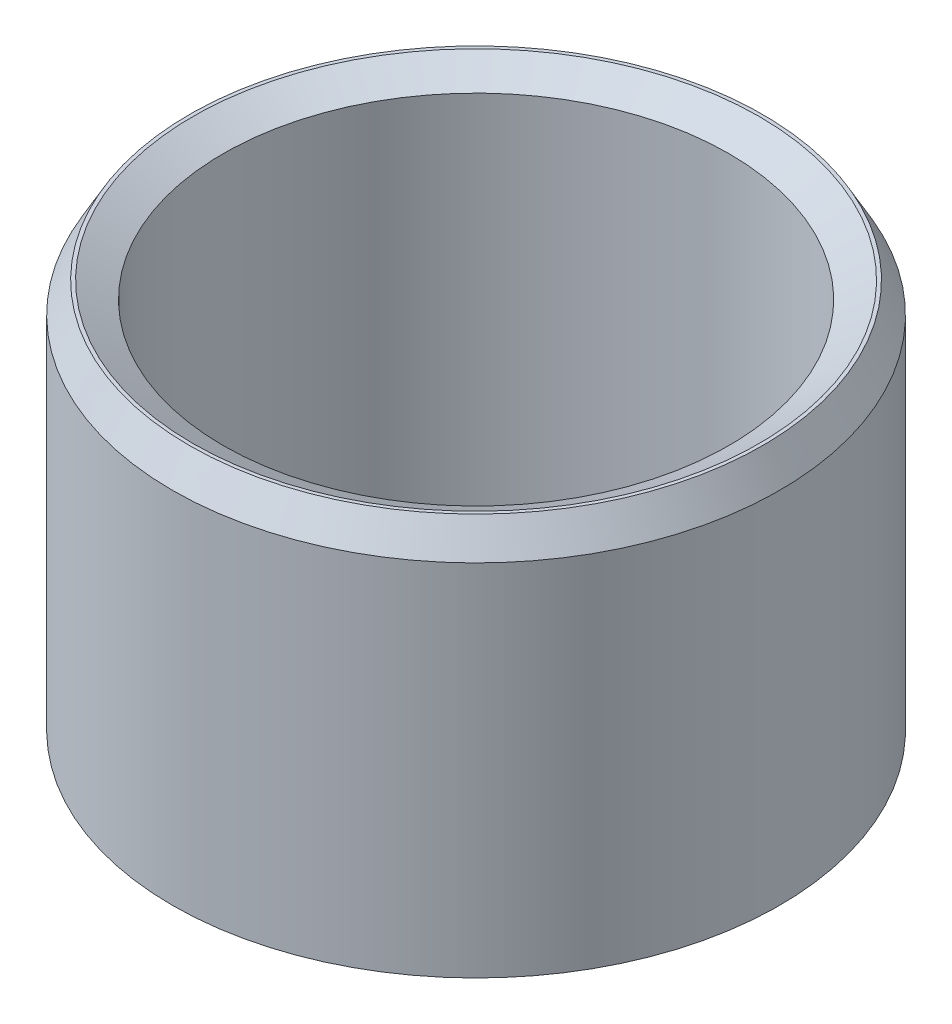
ISO-10303-21;
HEADER;
FILE_DESCRIPTION(('STEP AP214'),'2;1');
FILE_NAME('part.step','',(''),(''),'','','');
FILE_SCHEMA(('AUTOMOTIVE_DESIGN { 1 0 10303 214 1 1 1 1 }'));
ENDSEC;
DATA;
#1=APPLICATION_CONTEXT('core data for automotive mechanical design processes');
#2=APPLICATION_PROTOCOL_DEFINITION('international standard','automotive_design',2000,#1);
#3=PRODUCT_CONTEXT('',#1,'mechanical');
#4=PRODUCT('Part','Part','',(#3));
#5=PRODUCT_RELATED_PRODUCT_CATEGORY('part','',(#4));
#6=PRODUCT_DEFINITION_FORMATION('','',#4);
#7=PRODUCT_DEFINITION_CONTEXT('part definition',#1,'design');
#8=PRODUCT_DEFINITION('design','',#6,#7);
#9=PRODUCT_DEFINITION_SHAPE('','',#8);
#10=(LENGTH_UNIT() NAMED_UNIT(*) SI_UNIT(.MILLI.,.METRE.));
#11=(NAMED_UNIT(*) PLANE_ANGLE_UNIT() SI_UNIT($,.RADIAN.));
#12=(NAMED_UNIT(*) SI_UNIT($,.STERADIAN.) SOLID_ANGLE_UNIT());
#13=UNCERTAINTY_MEASURE_WITH_UNIT(LENGTH_MEASURE(1.E-05),#10,'distance_accuracy_value','');
#14=(GEOMETRIC_REPRESENTATION_CONTEXT(3) GLOBAL_UNCERTAINTY_ASSIGNED_CONTEXT((#13)) GLOBAL_UNIT_ASSIGNED_CONTEXT((#10,
#11,#12)) REPRESENTATION_CONTEXT('',''));
#15=CARTESIAN_POINT('',(0.,0.,0.));
#16=DIRECTION('',(0.,0.,1.));
#17=DIRECTION('',(1.,0.,0.));
#18=AXIS2_PLACEMENT_3D('',#15,#16,#17);
#19=CARTESIAN_POINT('',(0.,50.2277212319809,0.));
#20=DIRECTION('',(0.,-1.,0.));
#21=DIRECTION('',(0.,0.,-1.));
#22=AXIS2_PLACEMENT_3D('',#19,#20,#21);
#23=CYLINDRICAL_SURFACE('',#22,37.5);
#24=CARTESIAN_POINT('',(0.,2.09305694087893,0.));
#25=DIRECTION('',(0.,1.,0.));
#26=DIRECTION('',(0.,0.,1.));
#27=AXIS2_PLACEMENT_3D('',#24,#25,#26);
#28=CIRCLE('',#27,37.5);
#29=CARTESIAN_POINT('',(0.,2.09305694087893,37.5));
#30=VERTEX_POINT('',#29);
#31=EDGE_CURVE('E10',#30,#30,#28,.T.);
#32=ORIENTED_EDGE('',*,*,#31,.T.);
#33=EDGE_LOOP('',(#32));
#34=FACE_BOUND('',#33,.T.);
#35=CARTESIAN_POINT('',(0.,46.4844534185309,0.));
#36=DIRECTION('',(0.,1.,0.));
#37=DIRECTION('',(0.,0.,1.));
#38=AXIS2_PLACEMENT_3D('',#35,#36,#37);
#39=CIRCLE('',#38,37.5);
#40=CARTESIAN_POINT('',(0.,46.4844534185309,37.5));
#41=VERTEX_POINT('',#40);
#42=EDGE_CURVE('E50',#41,#41,#39,.F.);
#43=ORIENTED_EDGE('',*,*,#42,.T.);
#44=EDGE_LOOP('',(#43));
#45=FACE_BOUND('',#44,.T.);
#46=ADVANCED_FACE('F39',(#34,#45),#23,.T.);
#47=CARTESIAN_POINT('',(0.,50.2277212319809,0.));
#48=DIRECTION('',(0.,1.,0.));
#49=DIRECTION('',(0.,0.,1.));
#50=AXIS2_PLACEMENT_3D('',#47,#48,#49);
#51=PLANE('',#50);
#52=CARTESIAN_POINT('',(0.,50.2277212319809,0.));
#53=DIRECTION('',(0.,1.,0.));
#54=DIRECTION('',(0.,0.,1.));
#55=AXIS2_PLACEMENT_3D('',#52,#53,#54);
#56=CIRCLE('',#55,34.9738063882561);
#57=CARTESIAN_POINT('',(0.,50.2277212319809,34.9738063882561));
#58=VERTEX_POINT('',#57);
#59=EDGE_CURVE('E58',#58,#58,#56,.F.);
#60=ORIENTED_EDGE('',*,*,#59,.T.);
#61=EDGE_LOOP('',(#60));
#62=FACE_BOUND('',#61,.T.);
#63=CARTESIAN_POINT('',(0.,50.2277212319809,0.));
#64=DIRECTION('',(0.,1.,0.));
#65=DIRECTION('',(0.,0.,1.));
#66=AXIS2_PLACEMENT_3D('',#63,#64,#65);
#67=CIRCLE('',#66,35.4069430591211);
#68=CARTESIAN_POINT('',(0.,50.2277212319809,35.4069430591211));
#69=VERTEX_POINT('',#68);
#70=EDGE_CURVE('E61',#69,#69,#67,.T.);
#71=ORIENTED_EDGE('',*,*,#70,.T.);
#72=EDGE_LOOP('',(#71));
#73=FACE_BOUND('',#72,.T.);
#74=ADVANCED_FACE('F88',(#62,#73),#51,.T.);
#75=CARTESIAN_POINT('',(0.,0.,0.));
#76=DIRECTION('',(0.,1.,0.));
#77=DIRECTION('',(0.,0.,1.));
#78=AXIS2_PLACEMENT_3D('',#75,#76,#77);
#79=PLANE('',#78);
#80=CARTESIAN_POINT('',(0.,0.,0.));
#81=DIRECTION('',(0.,1.,0.));
#82=DIRECTION('',(0.,0.,1.));
#83=AXIS2_PLACEMENT_3D('',#80,#81,#82);
#84=CIRCLE('',#83,33.323595515685);
#85=CARTESIAN_POINT('',(0.,0.,-33.323595515685));
#86=VERTEX_POINT('',#85);
#87=EDGE_CURVE('E51',#86,#86,#84,.T.);
#88=ORIENTED_EDGE('',*,*,#87,.T.);
#89=EDGE_LOOP('',(#88));
#90=FACE_BOUND('',#89,.T.);
#91=CARTESIAN_POINT('',(0.,0.,0.));
#92=DIRECTION('',(0.,1.,0.));
#93=DIRECTION('',(0.,0.,1.));
#94=AXIS2_PLACEMENT_3D('',#91,#92,#93);
#95=CIRCLE('',#94,33.75673218655);
#96=CARTESIAN_POINT('',(0.,0.,33.75673218655));
#97=VERTEX_POINT('',#96);
#98=EDGE_CURVE('E54',#97,#97,#95,.F.);
#99=ORIENTED_EDGE('',*,*,#98,.T.);
#100=EDGE_LOOP('',(#99));
#101=FACE_BOUND('',#100,.T.);
#102=ADVANCED_FACE('F83',(#90,#101),#79,.F.);
#103=CARTESIAN_POINT('',(0.,50.2277212319809,0.));
#104=DIRECTION('',(0.,-1.,0.));
#105=DIRECTION('',(0.,0.,-1.));
#106=AXIS2_PLACEMENT_3D('',#103,#104,#105);
#107=CYLINDRICAL_SURFACE('',#106,31.2305385748061);
#108=CARTESIAN_POINT('',(0.,48.134664291102,0.));
#109=DIRECTION('',(0.,1.,0.));
#110=DIRECTION('',(0.,0.,1.));
#111=AXIS2_PLACEMENT_3D('',#108,#109,#110);
#112=CIRCLE('',#111,31.2305385748061);
#113=CARTESIAN_POINT('',(0.,48.134664291102,31.2305385748061));
#114=VERTEX_POINT('',#113);
#115=EDGE_CURVE('E67',#114,#114,#112,.T.);
#116=ORIENTED_EDGE('',*,*,#115,.T.);
#117=EDGE_LOOP('',(#116));
#118=FACE_BOUND('',#117,.T.);
#119=CARTESIAN_POINT('',(0.,3.74326781345003,0.));
#120=DIRECTION('',(0.,1.,0.));
#121=DIRECTION('',(0.,0.,1.));
#122=AXIS2_PLACEMENT_3D('',#119,#120,#121);
#123=CIRCLE('',#122,31.2305385748061);
#124=CARTESIAN_POINT('',(0.,3.74326781345003,-31.2305385748061));
#125=VERTEX_POINT('',#124);
#126=EDGE_CURVE('E69',#125,#125,#123,.F.);
#127=ORIENTED_EDGE('',*,*,#126,.T.);
#128=EDGE_LOOP('',(#127));
#129=FACE_BOUND('',#128,.T.);
#130=ADVANCED_FACE('F71',(#118,#129),#107,.F.);
#131=CARTESIAN_POINT('',(0.,48.134664291102,0.));
#132=DIRECTION('',(0.,1.,0.));
#133=DIRECTION('',(0.,0.,1.));
#134=AXIS2_PLACEMENT_3D('',#131,#132,#133);
#135=CONICAL_SURFACE('',#134,31.2305385748061,1.06095353674051);
#136=ORIENTED_EDGE('',*,*,#59,.F.);
#137=EDGE_LOOP('',(#136));
#138=FACE_BOUND('',#137,.T.);
#139=ORIENTED_EDGE('',*,*,#115,.F.);
#140=EDGE_LOOP('',(#139));
#141=FACE_BOUND('',#140,.T.);
#142=ADVANCED_FACE('F77',(#138,#141),#135,.F.);
#143=CARTESIAN_POINT('',(0.,0.,0.));
#144=DIRECTION('',(0.,-1.,0.));
#145=DIRECTION('',(0.,0.,-1.));
#146=AXIS2_PLACEMENT_3D('',#143,#144,#145);
#147=CONICAL_SURFACE('',#146,33.323595515685,0.509842790054379);
#148=CARTESIAN_POINT('',(0.,3.74326781345003,-31.2305385748061));
#149=CARTESIAN_POINT('',(0.,3.70427544039326,-31.2523412512736));
#150=CARTESIAN_POINT('',(0.,3.66528306733649,-31.2741439277411));
#151=CARTESIAN_POINT('',(0.,3.58729832122295,-31.3177492806761));
#152=CARTESIAN_POINT('',(0.,3.54830594816618,-31.3395519571436));
#153=CARTESIAN_POINT('',(0.,3.47032120205263,-31.3831573100785));
#154=CARTESIAN_POINT('',(0.,3.43132882899586,-31.404959986546));
#155=CARTESIAN_POINT('',(0.,3.35334408288232,-31.448565339481));
#156=CARTESIAN_POINT('',(0.,3.31435170982555,-31.4703680159485));
#157=CARTESIAN_POINT('',(0.,3.23636696371201,-31.5139733688835));
#158=CARTESIAN_POINT('',(0.,3.19737459065523,-31.535776045351));
#159=CARTESIAN_POINT('',(0.,3.11938984454169,-31.5793813982859));
#160=CARTESIAN_POINT('',(0.,3.08039747148492,-31.6011840747534));
#161=CARTESIAN_POINT('',(0.,3.00241272537138,-31.6447894276884));
#162=CARTESIAN_POINT('',(0.,2.96342035231461,-31.6665921041559));
#163=CARTESIAN_POINT('',(0.,2.88543560620106,-31.7101974570909));
#164=CARTESIAN_POINT('',(0.,2.84644323314429,-31.7320001335584));
#165=CARTESIAN_POINT('',(0.,2.76845848703075,-31.7756054864933));
#166=CARTESIAN_POINT('',(0.,2.72946611397398,-31.7974081629608));
#167=CARTESIAN_POINT('',(0.,2.65148136786044,-31.8410135158958));
#168=CARTESIAN_POINT('',(0.,2.61248899480367,-31.8628161923633));
#169=CARTESIAN_POINT('',(0.,2.53450424869013,-31.9064215452983));
#170=CARTESIAN_POINT('',(0.,2.49551187563335,-31.9282242217658));
#171=CARTESIAN_POINT('',(0.,2.41752712951981,-31.9718295747007));
#172=CARTESIAN_POINT('',(0.,2.37853475646304,-31.9936322511682));
#173=CARTESIAN_POINT('',(0.,2.3005500103495,-32.0372376041032));
#174=CARTESIAN_POINT('',(0.,2.26155763729273,-32.0590402805707));
#175=CARTESIAN_POINT('',(0.,2.18357289117918,-32.1026456335057));
#176=CARTESIAN_POINT('',(0.,2.14458051812241,-32.1244483099732));
#177=CARTESIAN_POINT('',(0.,2.06659577200887,-32.1680536629081));
#178=CARTESIAN_POINT('',(0.,2.0276033989521,-32.1898563393756));
#179=CARTESIAN_POINT('',(0.,1.94961865283856,-32.2334616923106));
#180=CARTESIAN_POINT('',(0.,1.91062627978179,-32.2552643687781));
#181=CARTESIAN_POINT('',(0.,1.83264153366824,-32.2988697217131));
#182=CARTESIAN_POINT('',(0.,1.79364916061147,-32.3206723981806));
#183=CARTESIAN_POINT('',(0.,1.71566441449793,-32.3642777511155));
#184=CARTESIAN_POINT('',(0.,1.67667204144116,-32.386080427583));
#185=CARTESIAN_POINT('',(0.,1.59868729532762,-32.429685780518));
#186=CARTESIAN_POINT('',(0.,1.55969492227085,-32.4514884569855));
#187=CARTESIAN_POINT('',(0.,1.4817101761573,-32.4950938099205));
#188=CARTESIAN_POINT('',(0.,1.44271780310053,-32.5168964863879));
#189=CARTESIAN_POINT('',(0.,1.36473305698699,-32.5605018393229));
#190=CARTESIAN_POINT('',(0.,1.32574068393022,-32.5823045157904));
#191=CARTESIAN_POINT('',(0.,1.24775593781668,-32.6259098687254));
#192=CARTESIAN_POINT('',(0.,1.20876356475991,-32.6477125451929));
#193=CARTESIAN_POINT('',(0.,1.13077881864636,-32.6913178981279));
#194=CARTESIAN_POINT('',(0.,1.09178644558959,-32.7131205745954));
#195=CARTESIAN_POINT('',(0.,1.01380169947605,-32.7567259275303));
#196=CARTESIAN_POINT('',(0.,0.974809326419279,-32.7785286039978));
#197=CARTESIAN_POINT('',(0.,0.896824580305737,-32.8221339569328));
#198=CARTESIAN_POINT('',(0.,0.857832207248965,-32.8439366334003));
#199=CARTESIAN_POINT('',(0.,0.779847461135423,-32.8875419863353));
#200=CARTESIAN_POINT('',(0.,0.740855088078652,-32.9093446628028));
#201=CARTESIAN_POINT('',(0.,0.66287034196511,-32.9529500157377));
#202=CARTESIAN_POINT('',(0.,0.623877968908338,-32.9747526922052));
#203=CARTESIAN_POINT('',(0.,0.545893222794795,-33.0183580451402));
#204=CARTESIAN_POINT('',(0.,0.506900849738025,-33.0401607216077));
#205=CARTESIAN_POINT('',(0.,0.428916103624483,-33.0837660745427));
#206=CARTESIAN_POINT('',(0.,0.389923730567711,-33.1055687510101));
#207=CARTESIAN_POINT('',(0.,0.311938984454169,-33.1491741039451));
#208=CARTESIAN_POINT('',(0.,0.272946611397398,-33.1709767804126));
#209=CARTESIAN_POINT('',(0.,0.194961865283856,-33.2145821333476));
#210=CARTESIAN_POINT('',(0.,0.155969492227085,-33.2363848098151));
#211=CARTESIAN_POINT('',(0.,0.0779847461135411,-33.2799901627501));
#212=CARTESIAN_POINT('',(0.,0.0389923730567694,-33.3017928392175));
#213=CARTESIAN_POINT('',(0.,0.,-33.323595515685));
#214=B_SPLINE_CURVE_WITH_KNOTS('',3,(#148,#149,#150,#151,#152,#153,#154,#155,#156,#157,#158,
#159,#160,#161,#162,#163,#164,#165,#166,#167,#168,#169,#170,#171,#172,#173,#174,#175,#176,#177,
#178,#179,#180,#181,#182,#183,#184,#185,#186,#187,#188,#189,#190,#191,#192,#193,#194,#195,#196,
#197,#198,#199,#200,#201,#202,#203,#204,#205,#206,#207,#208,#209,#210,#211,#212,#213),
.UNSPECIFIED.,.F.,.F.,(4,2,2,2,2,2,2,2,2,2,2,2,2,2,2,2,2,2,2,2,2,2,2,2,2,2,2,2,2,2,2,2,4),(0.,
0.134021851650018,0.268043703300039,0.402065554950056,0.536087406600076,0.670109258250092,
0.804131109900113,0.93815296155013,1.07217481320015,1.20619666485017,1.34021851650019,
1.47424036815021,1.60826221980022,1.74228407145024,1.87630592310026,2.01032777475028,
2.1443496264003,2.27837147805032,2.41239332970033,2.54641518135036,2.68043703300037,
2.81445888465039,2.94848073630041,3.08250258795043,3.21652443960045,3.35054629125047,
3.48456814290049,3.6185899945505,3.75261184620052,3.88663369785054,4.02065554950056,
4.15467740115058,4.2886992528006),.UNSPECIFIED.);
#215=EDGE_CURVE('BSEAM73',#125,#86,#214,.T.);
#216=ORIENTED_EDGE('',*,*,#126,.F.);
#217=ORIENTED_EDGE('',*,*,#87,.F.);
#218=ORIENTED_EDGE('',*,*,#215,.T.);
#219=ORIENTED_EDGE('',*,*,#215,.F.);
#220=EDGE_LOOP('',(#216,#218,#217,#219));
#221=FACE_BOUND('',#220,.T.);
#222=ADVANCED_FACE('F73',(#221),#147,.F.);
#223=CARTESIAN_POINT('',(0.,2.09305694087893,0.));
#224=DIRECTION('',(0.,1.,0.));
#225=DIRECTION('',(0.,0.,1.));
#226=AXIS2_PLACEMENT_3D('',#223,#224,#225);
#227=CONICAL_SURFACE('',#226,37.5,1.06095353674052);
#228=ORIENTED_EDGE('',*,*,#98,.F.);
#229=EDGE_LOOP('',(#228));
#230=FACE_BOUND('',#229,.T.);
#231=ORIENTED_EDGE('',*,*,#31,.F.);
#232=EDGE_LOOP('',(#231));
#233=FACE_BOUND('',#232,.T.);
#234=ADVANCED_FACE('F76',(#230,#233),#227,.T.);
#235=CARTESIAN_POINT('',(0.,50.2277212319809,0.));
#236=DIRECTION('',(0.,-1.,0.));
#237=DIRECTION('',(0.,0.,-1.));
#238=AXIS2_PLACEMENT_3D('',#235,#236,#237);
#239=CONICAL_SURFACE('',#238,35.4069430591211,0.50984279005438);
#240=ORIENTED_EDGE('',*,*,#42,.F.);
#241=EDGE_LOOP('',(#240));
#242=FACE_BOUND('',#241,.T.);
#243=ORIENTED_EDGE('',*,*,#70,.F.);
#244=EDGE_LOOP('',(#243));
#245=FACE_BOUND('',#244,.T.);
#246=ADVANCED_FACE('F45',(#242,#245),#239,.T.);
#247=CLOSED_SHELL('',(#46,#74,#102,#130,#142,#222,#234,#246));
#248=MANIFOLD_SOLID_BREP('B2',#247);
#249=ADVANCED_BREP_SHAPE_REPRESENTATION('',(#18,#248),#14);
#250=SHAPE_DEFINITION_REPRESENTATION(#9,#249);
ENDSEC;
END-ISO-10303-21;
